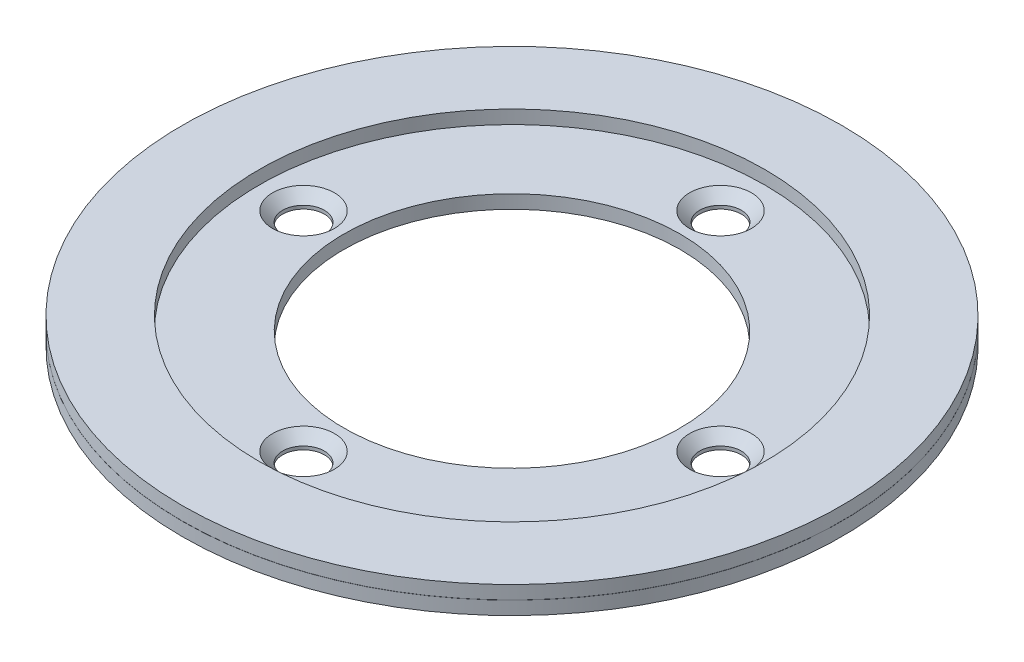
ISO-10303-21;
HEADER;
FILE_DESCRIPTION(('STEP AP214'),'2;1');
FILE_NAME('part.step','',(''),(''),'','','');
FILE_SCHEMA(('AUTOMOTIVE_DESIGN { 1 0 10303 214 1 1 1 1 }'));
ENDSEC;
DATA;
#1=APPLICATION_CONTEXT('core data for automotive mechanical design processes');
#2=APPLICATION_PROTOCOL_DEFINITION('international standard','automotive_design',2000,#1);
#3=PRODUCT_CONTEXT('',#1,'mechanical');
#4=PRODUCT('Part','Part','',(#3));
#5=PRODUCT_RELATED_PRODUCT_CATEGORY('part','',(#4));
#6=PRODUCT_DEFINITION_FORMATION('','',#4);
#7=PRODUCT_DEFINITION_CONTEXT('part definition',#1,'design');
#8=PRODUCT_DEFINITION('design','',#6,#7);
#9=PRODUCT_DEFINITION_SHAPE('','',#8);
#10=(LENGTH_UNIT() NAMED_UNIT(*) SI_UNIT(.MILLI.,.METRE.));
#11=(NAMED_UNIT(*) PLANE_ANGLE_UNIT() SI_UNIT($,.RADIAN.));
#12=(NAMED_UNIT(*) SI_UNIT($,.STERADIAN.) SOLID_ANGLE_UNIT());
#13=UNCERTAINTY_MEASURE_WITH_UNIT(LENGTH_MEASURE(1.E-05),#10,'distance_accuracy_value','');
#14=(GEOMETRIC_REPRESENTATION_CONTEXT(3) GLOBAL_UNCERTAINTY_ASSIGNED_CONTEXT((#13)) GLOBAL_UNIT_ASSIGNED_CONTEXT((#10,
#11,#12)) REPRESENTATION_CONTEXT('',''));
#15=CARTESIAN_POINT('',(0.,0.,0.));
#16=DIRECTION('',(0.,0.,1.));
#17=DIRECTION('',(1.,0.,0.));
#18=AXIS2_PLACEMENT_3D('',#15,#16,#17);
#19=CARTESIAN_POINT('',(-12.5,1.,0.));
#20=DIRECTION('',(0.,-1.,0.));
#21=DIRECTION('',(0.,0.,-1.));
#22=AXIS2_PLACEMENT_3D('',#19,#20,#21);
#23=PLANE('',#22);
#24=CARTESIAN_POINT('',(0.,1.,-15.5));
#25=DIRECTION('',(0.,1.,0.));
#26=DIRECTION('',(0.,0.,1.));
#27=AXIS2_PLACEMENT_3D('',#24,#25,#26);
#28=CIRCLE('',#27,2.3);
#29=CARTESIAN_POINT('',(0.,1.,-13.2));
#30=VERTEX_POINT('',#29);
#31=EDGE_CURVE('E129',#30,#30,#28,.T.);
#32=ORIENTED_EDGE('',*,*,#31,.F.);
#33=EDGE_LOOP('',(#32));
#34=FACE_BOUND('',#33,.T.);
#35=CARTESIAN_POINT('',(-15.5,1.,0.));
#36=DIRECTION('',(0.,1.,0.));
#37=DIRECTION('',(0.,0.,1.));
#38=AXIS2_PLACEMENT_3D('',#35,#36,#37);
#39=CIRCLE('',#38,2.3);
#40=CARTESIAN_POINT('',(-15.5,1.,2.3));
#41=VERTEX_POINT('',#40);
#42=EDGE_CURVE('E117',#41,#41,#39,.T.);
#43=ORIENTED_EDGE('',*,*,#42,.F.);
#44=EDGE_LOOP('',(#43));
#45=FACE_BOUND('',#44,.T.);
#46=CARTESIAN_POINT('',(0.,1.,15.5));
#47=DIRECTION('',(0.,1.,0.));
#48=DIRECTION('',(0.,0.,1.));
#49=AXIS2_PLACEMENT_3D('',#46,#47,#48);
#50=CIRCLE('',#49,2.3);
#51=CARTESIAN_POINT('',(0.,1.,17.8));
#52=VERTEX_POINT('',#51);
#53=EDGE_CURVE('E105',#52,#52,#50,.T.);
#54=ORIENTED_EDGE('',*,*,#53,.F.);
#55=EDGE_LOOP('',(#54));
#56=FACE_BOUND('',#55,.T.);
#57=CARTESIAN_POINT('',(0.,1.,0.));
#58=DIRECTION('',(0.,-1.,0.));
#59=DIRECTION('',(0.,0.,-1.));
#60=AXIS2_PLACEMENT_3D('',#57,#58,#59);
#61=CIRCLE('',#60,12.5);
#62=CARTESIAN_POINT('',(0.,1.,-12.5));
#63=VERTEX_POINT('',#62);
#64=EDGE_CURVE('E75',#63,#63,#61,.T.);
#65=ORIENTED_EDGE('',*,*,#64,.T.);
#66=EDGE_LOOP('',(#65));
#67=FACE_BOUND('',#66,.T.);
#68=CARTESIAN_POINT('',(0.,1.,0.));
#69=DIRECTION('',(0.,-1.,0.));
#70=DIRECTION('',(0.,0.,-1.));
#71=AXIS2_PLACEMENT_3D('',#68,#69,#70);
#72=CIRCLE('',#71,18.8);
#73=CARTESIAN_POINT('',(0.,1.,-18.8));
#74=VERTEX_POINT('',#73);
#75=EDGE_CURVE('E72',#74,#74,#72,.T.);
#76=ORIENTED_EDGE('',*,*,#75,.F.);
#77=EDGE_LOOP('',(#76));
#78=FACE_BOUND('',#77,.T.);
#79=CARTESIAN_POINT('',(15.5,1.,0.));
#80=DIRECTION('',(0.,1.,0.));
#81=DIRECTION('',(0.,0.,1.));
#82=AXIS2_PLACEMENT_3D('',#79,#80,#81);
#83=CIRCLE('',#82,2.3);
#84=CARTESIAN_POINT('',(15.5,1.,2.3));
#85=VERTEX_POINT('',#84);
#86=EDGE_CURVE('E94',#85,#85,#83,.T.);
#87=ORIENTED_EDGE('',*,*,#86,.F.);
#88=EDGE_LOOP('',(#87));
#89=FACE_BOUND('',#88,.T.);
#90=ADVANCED_FACE('F37',(#34,#45,#56,#67,#78,#89),#23,.F.);
#91=CARTESIAN_POINT('',(0.,0.,0.));
#92=DIRECTION('',(0.,-1.,0.));
#93=DIRECTION('',(0.,0.,-1.));
#94=AXIS2_PLACEMENT_3D('',#91,#92,#93);
#95=CYLINDRICAL_SURFACE('',#94,24.5);
#96=CARTESIAN_POINT('',(0.,0.,0.));
#97=DIRECTION('',(0.,-1.,0.));
#98=DIRECTION('',(0.,0.,-1.));
#99=AXIS2_PLACEMENT_3D('',#96,#97,#98);
#100=CIRCLE('',#99,24.5);
#101=CARTESIAN_POINT('',(0.,0.,-24.5));
#102=VERTEX_POINT('',#101);
#103=EDGE_CURVE('E83',#102,#102,#100,.T.);
#104=ORIENTED_EDGE('',*,*,#103,.F.);
#105=EDGE_LOOP('',(#104));
#106=FACE_BOUND('',#105,.T.);
#107=CARTESIAN_POINT('',(0.,0.995,0.));
#108=DIRECTION('',(0.,-1.,0.));
#109=DIRECTION('',(0.,0.,-1.));
#110=AXIS2_PLACEMENT_3D('',#107,#108,#109);
#111=CIRCLE('',#110,24.5);
#112=CARTESIAN_POINT('',(0.,0.995,-24.5));
#113=VERTEX_POINT('',#112);
#114=EDGE_CURVE('E10',#113,#113,#111,.T.);
#115=ORIENTED_EDGE('',*,*,#114,.T.);
#116=EDGE_LOOP('',(#115));
#117=FACE_BOUND('',#116,.T.);
#118=ADVANCED_FACE('F39',(#106,#117),#95,.T.);
#119=CARTESIAN_POINT('',(-24.5,0.995,0.));
#120=DIRECTION('',(0.,-1.,0.));
#121=DIRECTION('',(0.,0.,-1.));
#122=AXIS2_PLACEMENT_3D('',#119,#120,#121);
#123=PLANE('',#122);
#124=ORIENTED_EDGE('',*,*,#114,.F.);
#125=EDGE_LOOP('',(#124));
#126=FACE_BOUND('',#125,.T.);
#127=CARTESIAN_POINT('',(0.,0.995,0.));
#128=DIRECTION('',(0.,-1.,0.));
#129=DIRECTION('',(0.,0.,-1.));
#130=AXIS2_PLACEMENT_3D('',#127,#128,#129);
#131=CIRCLE('',#130,24.);
#132=CARTESIAN_POINT('',(0.,0.995,-24.));
#133=VERTEX_POINT('',#132);
#134=EDGE_CURVE('E45',#133,#133,#131,.T.);
#135=ORIENTED_EDGE('',*,*,#134,.T.);
#136=EDGE_LOOP('',(#135));
#137=FACE_BOUND('',#136,.T.);
#138=ADVANCED_FACE('F193',(#126,#137),#123,.F.);
#139=CARTESIAN_POINT('',(0.,0.,0.));
#140=DIRECTION('',(0.,-1.,0.));
#141=DIRECTION('',(0.,0.,-1.));
#142=AXIS2_PLACEMENT_3D('',#139,#140,#141);
#143=CYLINDRICAL_SURFACE('',#142,24.);
#144=ORIENTED_EDGE('',*,*,#134,.F.);
#145=EDGE_LOOP('',(#144));
#146=FACE_BOUND('',#145,.T.);
#147=CARTESIAN_POINT('',(0.,1.005,0.));
#148=DIRECTION('',(0.,-1.,0.));
#149=DIRECTION('',(0.,0.,-1.));
#150=AXIS2_PLACEMENT_3D('',#147,#148,#149);
#151=CIRCLE('',#150,24.);
#152=CARTESIAN_POINT('',(0.,1.005,-24.));
#153=VERTEX_POINT('',#152);
#154=EDGE_CURVE('E52',#153,#153,#151,.T.);
#155=ORIENTED_EDGE('',*,*,#154,.T.);
#156=EDGE_LOOP('',(#155));
#157=FACE_BOUND('',#156,.T.);
#158=ADVANCED_FACE('F190',(#146,#157),#143,.T.);
#159=CARTESIAN_POINT('',(-24.5,1.005,0.));
#160=DIRECTION('',(0.,1.,0.));
#161=DIRECTION('',(0.,0.,1.));
#162=AXIS2_PLACEMENT_3D('',#159,#160,#161);
#163=PLANE('',#162);
#164=ORIENTED_EDGE('',*,*,#154,.F.);
#165=EDGE_LOOP('',(#164));
#166=FACE_BOUND('',#165,.T.);
#167=CARTESIAN_POINT('',(0.,1.005,0.));
#168=DIRECTION('',(0.,-1.,0.));
#169=DIRECTION('',(0.,0.,-1.));
#170=AXIS2_PLACEMENT_3D('',#167,#168,#169);
#171=CIRCLE('',#170,24.5);
#172=CARTESIAN_POINT('',(0.,1.005,-24.5));
#173=VERTEX_POINT('',#172);
#174=EDGE_CURVE('E59',#173,#173,#171,.T.);
#175=ORIENTED_EDGE('',*,*,#174,.T.);
#176=EDGE_LOOP('',(#175));
#177=FACE_BOUND('',#176,.T.);
#178=ADVANCED_FACE('F186',(#166,#177),#163,.F.);
#179=CARTESIAN_POINT('',(0.,0.,0.));
#180=DIRECTION('',(0.,-1.,0.));
#181=DIRECTION('',(0.,0.,-1.));
#182=AXIS2_PLACEMENT_3D('',#179,#180,#181);
#183=CYLINDRICAL_SURFACE('',#182,24.5);
#184=ORIENTED_EDGE('',*,*,#174,.F.);
#185=EDGE_LOOP('',(#184));
#186=FACE_BOUND('',#185,.T.);
#187=CARTESIAN_POINT('',(0.,2.,0.));
#188=DIRECTION('',(0.,-1.,0.));
#189=DIRECTION('',(0.,0.,-1.));
#190=AXIS2_PLACEMENT_3D('',#187,#188,#189);
#191=CIRCLE('',#190,24.5);
#192=CARTESIAN_POINT('',(0.,2.,-24.5));
#193=VERTEX_POINT('',#192);
#194=EDGE_CURVE('E64',#193,#193,#191,.T.);
#195=ORIENTED_EDGE('',*,*,#194,.T.);
#196=EDGE_LOOP('',(#195));
#197=FACE_BOUND('',#196,.T.);
#198=ADVANCED_FACE('F182',(#186,#197),#183,.T.);
#199=CARTESIAN_POINT('',(-24.5,2.,0.));
#200=DIRECTION('',(0.,-1.,0.));
#201=DIRECTION('',(0.,0.,-1.));
#202=AXIS2_PLACEMENT_3D('',#199,#200,#201);
#203=PLANE('',#202);
#204=ORIENTED_EDGE('',*,*,#194,.F.);
#205=EDGE_LOOP('',(#204));
#206=FACE_BOUND('',#205,.T.);
#207=CARTESIAN_POINT('',(0.,2.,0.));
#208=DIRECTION('',(0.,-1.,0.));
#209=DIRECTION('',(0.,0.,-1.));
#210=AXIS2_PLACEMENT_3D('',#207,#208,#209);
#211=CIRCLE('',#210,18.8);
#212=CARTESIAN_POINT('',(0.,2.,-18.8));
#213=VERTEX_POINT('',#212);
#214=EDGE_CURVE('E68',#213,#213,#211,.T.);
#215=ORIENTED_EDGE('',*,*,#214,.T.);
#216=EDGE_LOOP('',(#215));
#217=FACE_BOUND('',#216,.T.);
#218=ADVANCED_FACE('F178',(#206,#217),#203,.F.);
#219=CARTESIAN_POINT('',(0.,0.,0.));
#220=DIRECTION('',(0.,-1.,0.));
#221=DIRECTION('',(0.,0.,-1.));
#222=AXIS2_PLACEMENT_3D('',#219,#220,#221);
#223=CYLINDRICAL_SURFACE('',#222,18.8);
#224=ORIENTED_EDGE('',*,*,#214,.F.);
#225=EDGE_LOOP('',(#224));
#226=FACE_BOUND('',#225,.T.);
#227=ORIENTED_EDGE('',*,*,#75,.T.);
#228=EDGE_LOOP('',(#227));
#229=FACE_BOUND('',#228,.T.);
#230=ADVANCED_FACE('F173',(#226,#229),#223,.F.);
#231=CARTESIAN_POINT('',(0.,0.,0.));
#232=DIRECTION('',(0.,-1.,0.));
#233=DIRECTION('',(0.,0.,-1.));
#234=AXIS2_PLACEMENT_3D('',#231,#232,#233);
#235=CYLINDRICAL_SURFACE('',#234,12.5);
#236=ORIENTED_EDGE('',*,*,#64,.F.);
#237=EDGE_LOOP('',(#236));
#238=FACE_BOUND('',#237,.T.);
#239=CARTESIAN_POINT('',(0.,0.,0.));
#240=DIRECTION('',(0.,-1.,0.));
#241=DIRECTION('',(0.,0.,-1.));
#242=AXIS2_PLACEMENT_3D('',#239,#240,#241);
#243=CIRCLE('',#242,12.5);
#244=CARTESIAN_POINT('',(0.,0.,-12.5));
#245=VERTEX_POINT('',#244);
#246=EDGE_CURVE('E79',#245,#245,#243,.T.);
#247=ORIENTED_EDGE('',*,*,#246,.T.);
#248=EDGE_LOOP('',(#247));
#249=FACE_BOUND('',#248,.T.);
#250=ADVANCED_FACE('F170',(#238,#249),#235,.F.);
#251=CARTESIAN_POINT('',(-24.5,0.,0.));
#252=DIRECTION('',(0.,1.,0.));
#253=DIRECTION('',(0.,0.,1.));
#254=AXIS2_PLACEMENT_3D('',#251,#252,#253);
#255=PLANE('',#254);
#256=CARTESIAN_POINT('',(0.,0.,-15.5));
#257=DIRECTION('',(0.,1.,0.));
#258=DIRECTION('',(0.,0.,1.));
#259=AXIS2_PLACEMENT_3D('',#256,#257,#258);
#260=CIRCLE('',#259,1.55);
#261=CARTESIAN_POINT('',(0.,0.,-13.95));
#262=VERTEX_POINT('',#261);
#263=EDGE_CURVE('E121',#262,#262,#260,.T.);
#264=ORIENTED_EDGE('',*,*,#263,.T.);
#265=EDGE_LOOP('',(#264));
#266=FACE_BOUND('',#265,.T.);
#267=CARTESIAN_POINT('',(-15.5,0.,0.));
#268=DIRECTION('',(0.,1.,0.));
#269=DIRECTION('',(0.,0.,1.));
#270=AXIS2_PLACEMENT_3D('',#267,#268,#269);
#271=CIRCLE('',#270,1.55);
#272=CARTESIAN_POINT('',(-15.5,0.,1.55));
#273=VERTEX_POINT('',#272);
#274=EDGE_CURVE('E109',#273,#273,#271,.T.);
#275=ORIENTED_EDGE('',*,*,#274,.T.);
#276=EDGE_LOOP('',(#275));
#277=FACE_BOUND('',#276,.T.);
#278=CARTESIAN_POINT('',(0.,0.,15.5));
#279=DIRECTION('',(0.,1.,0.));
#280=DIRECTION('',(0.,0.,1.));
#281=AXIS2_PLACEMENT_3D('',#278,#279,#280);
#282=CIRCLE('',#281,1.55);
#283=CARTESIAN_POINT('',(0.,0.,17.05));
#284=VERTEX_POINT('',#283);
#285=EDGE_CURVE('E97',#284,#284,#282,.T.);
#286=ORIENTED_EDGE('',*,*,#285,.T.);
#287=EDGE_LOOP('',(#286));
#288=FACE_BOUND('',#287,.T.);
#289=CARTESIAN_POINT('',(15.5,0.,0.));
#290=DIRECTION('',(0.,1.,0.));
#291=DIRECTION('',(0.,0.,1.));
#292=AXIS2_PLACEMENT_3D('',#289,#290,#291);
#293=CIRCLE('',#292,1.55);
#294=CARTESIAN_POINT('',(15.5,0.,1.55));
#295=VERTEX_POINT('',#294);
#296=EDGE_CURVE('E86',#295,#295,#293,.T.);
#297=ORIENTED_EDGE('',*,*,#296,.T.);
#298=EDGE_LOOP('',(#297));
#299=FACE_BOUND('',#298,.T.);
#300=ORIENTED_EDGE('',*,*,#246,.F.);
#301=EDGE_LOOP('',(#300));
#302=FACE_BOUND('',#301,.T.);
#303=ORIENTED_EDGE('',*,*,#103,.T.);
#304=EDGE_LOOP('',(#303));
#305=FACE_BOUND('',#304,.T.);
#306=ADVANCED_FACE('F162',(#266,#277,#288,#299,#302,#305),#255,.F.);
#307=CARTESIAN_POINT('',(15.5,1.,0.));
#308=DIRECTION('',(0.,1.,0.));
#309=DIRECTION('',(0.,0.,1.));
#310=AXIS2_PLACEMENT_3D('',#307,#308,#309);
#311=CYLINDRICAL_SURFACE('',#310,1.55);
#312=ORIENTED_EDGE('',*,*,#296,.F.);
#313=EDGE_LOOP('',(#312));
#314=FACE_BOUND('',#313,.T.);
#315=CARTESIAN_POINT('',(15.5,0.25,0.));
#316=DIRECTION('',(0.,1.,0.));
#317=DIRECTION('',(0.,0.,1.));
#318=AXIS2_PLACEMENT_3D('',#315,#316,#317);
#319=CIRCLE('',#318,1.55);
#320=CARTESIAN_POINT('',(15.5,0.25,1.55));
#321=VERTEX_POINT('',#320);
#322=EDGE_CURVE('E90',#321,#321,#319,.T.);
#323=ORIENTED_EDGE('',*,*,#322,.T.);
#324=EDGE_LOOP('',(#323));
#325=FACE_BOUND('',#324,.T.);
#326=ADVANCED_FACE('F152',(#314,#325),#311,.F.);
#327=CARTESIAN_POINT('',(15.5,1.,0.));
#328=DIRECTION('',(0.,1.,0.));
#329=DIRECTION('',(0.,0.,1.));
#330=AXIS2_PLACEMENT_3D('',#327,#328,#329);
#331=CONICAL_SURFACE('',#330,2.3,0.785398163397449);
#332=ORIENTED_EDGE('',*,*,#322,.F.);
#333=EDGE_LOOP('',(#332));
#334=FACE_BOUND('',#333,.T.);
#335=ORIENTED_EDGE('',*,*,#86,.T.);
#336=EDGE_LOOP('',(#335));
#337=FACE_BOUND('',#336,.T.);
#338=ADVANCED_FACE('F149',(#334,#337),#331,.F.);
#339=CARTESIAN_POINT('',(0.,1.,15.5));
#340=DIRECTION('',(0.,1.,0.));
#341=DIRECTION('',(0.,0.,1.));
#342=AXIS2_PLACEMENT_3D('',#339,#340,#341);
#343=CYLINDRICAL_SURFACE('',#342,1.55);
#344=ORIENTED_EDGE('',*,*,#285,.F.);
#345=EDGE_LOOP('',(#344));
#346=FACE_BOUND('',#345,.T.);
#347=CARTESIAN_POINT('',(0.,0.25,15.5));
#348=DIRECTION('',(0.,1.,0.));
#349=DIRECTION('',(0.,0.,1.));
#350=AXIS2_PLACEMENT_3D('',#347,#348,#349);
#351=CIRCLE('',#350,1.55);
#352=CARTESIAN_POINT('',(0.,0.25,17.05));
#353=VERTEX_POINT('',#352);
#354=EDGE_CURVE('E101',#353,#353,#351,.T.);
#355=ORIENTED_EDGE('',*,*,#354,.T.);
#356=EDGE_LOOP('',(#355));
#357=FACE_BOUND('',#356,.T.);
#358=ADVANCED_FACE('F151',(#346,#357),#343,.F.);
#359=CARTESIAN_POINT('',(0.,1.,15.5));
#360=DIRECTION('',(0.,1.,0.));
#361=DIRECTION('',(0.,0.,1.));
#362=AXIS2_PLACEMENT_3D('',#359,#360,#361);
#363=CONICAL_SURFACE('',#362,2.3,0.785398163397448);
#364=ORIENTED_EDGE('',*,*,#354,.F.);
#365=EDGE_LOOP('',(#364));
#366=FACE_BOUND('',#365,.T.);
#367=ORIENTED_EDGE('',*,*,#53,.T.);
#368=EDGE_LOOP('',(#367));
#369=FACE_BOUND('',#368,.T.);
#370=ADVANCED_FACE('F159',(#366,#369),#363,.F.);
#371=CARTESIAN_POINT('',(-15.5,1.,0.));
#372=DIRECTION('',(0.,1.,0.));
#373=DIRECTION('',(0.,0.,1.));
#374=AXIS2_PLACEMENT_3D('',#371,#372,#373);
#375=CYLINDRICAL_SURFACE('',#374,1.55);
#376=ORIENTED_EDGE('',*,*,#274,.F.);
#377=EDGE_LOOP('',(#376));
#378=FACE_BOUND('',#377,.T.);
#379=CARTESIAN_POINT('',(-15.5,0.25,0.));
#380=DIRECTION('',(0.,1.,0.));
#381=DIRECTION('',(0.,0.,1.));
#382=AXIS2_PLACEMENT_3D('',#379,#380,#381);
#383=CIRCLE('',#382,1.55);
#384=CARTESIAN_POINT('',(-15.5,0.25,1.55));
#385=VERTEX_POINT('',#384);
#386=EDGE_CURVE('E113',#385,#385,#383,.T.);
#387=ORIENTED_EDGE('',*,*,#386,.T.);
#388=EDGE_LOOP('',(#387));
#389=FACE_BOUND('',#388,.T.);
#390=ADVANCED_FACE('F247',(#378,#389),#375,.F.);
#391=CARTESIAN_POINT('',(-15.5,1.,0.));
#392=DIRECTION('',(0.,1.,0.));
#393=DIRECTION('',(0.,0.,1.));
#394=AXIS2_PLACEMENT_3D('',#391,#392,#393);
#395=CONICAL_SURFACE('',#394,2.3,0.785398163397449);
#396=ORIENTED_EDGE('',*,*,#386,.F.);
#397=EDGE_LOOP('',(#396));
#398=FACE_BOUND('',#397,.T.);
#399=ORIENTED_EDGE('',*,*,#42,.T.);
#400=EDGE_LOOP('',(#399));
#401=FACE_BOUND('',#400,.T.);
#402=ADVANCED_FACE('F256',(#398,#401),#395,.F.);
#403=CARTESIAN_POINT('',(0.,1.,-15.5));
#404=DIRECTION('',(0.,1.,0.));
#405=DIRECTION('',(0.,0.,1.));
#406=AXIS2_PLACEMENT_3D('',#403,#404,#405);
#407=CYLINDRICAL_SURFACE('',#406,1.55);
#408=ORIENTED_EDGE('',*,*,#263,.F.);
#409=EDGE_LOOP('',(#408));
#410=FACE_BOUND('',#409,.T.);
#411=CARTESIAN_POINT('',(0.,0.25,-15.5));
#412=DIRECTION('',(0.,1.,0.));
#413=DIRECTION('',(0.,0.,1.));
#414=AXIS2_PLACEMENT_3D('',#411,#412,#413);
#415=CIRCLE('',#414,1.55);
#416=CARTESIAN_POINT('',(0.,0.25,-13.95));
#417=VERTEX_POINT('',#416);
#418=EDGE_CURVE('E125',#417,#417,#415,.T.);
#419=ORIENTED_EDGE('',*,*,#418,.T.);
#420=EDGE_LOOP('',(#419));
#421=FACE_BOUND('',#420,.T.);
#422=ADVANCED_FACE('F266',(#410,#421),#407,.F.);
#423=CARTESIAN_POINT('',(0.,1.,-15.5));
#424=DIRECTION('',(0.,1.,0.));
#425=DIRECTION('',(0.,0.,1.));
#426=AXIS2_PLACEMENT_3D('',#423,#424,#425);
#427=CONICAL_SURFACE('',#426,2.3,0.785398163397448);
#428=ORIENTED_EDGE('',*,*,#418,.F.);
#429=EDGE_LOOP('',(#428));
#430=FACE_BOUND('',#429,.T.);
#431=ORIENTED_EDGE('',*,*,#31,.T.);
#432=EDGE_LOOP('',(#431));
#433=FACE_BOUND('',#432,.T.);
#434=ADVANCED_FACE('F134',(#430,#433),#427,.F.);
#435=CLOSED_SHELL('',(#90,#118,#138,#158,#178,#198,#218,#230,#250,#306,#326,#338,#358,#370,#390,
#402,#422,#434));
#436=MANIFOLD_SOLID_BREP('B2',#435);
#437=ADVANCED_BREP_SHAPE_REPRESENTATION('',(#18,#436),#14);
#438=SHAPE_DEFINITION_REPRESENTATION(#9,#437);
ENDSEC;
END-ISO-10303-21;
